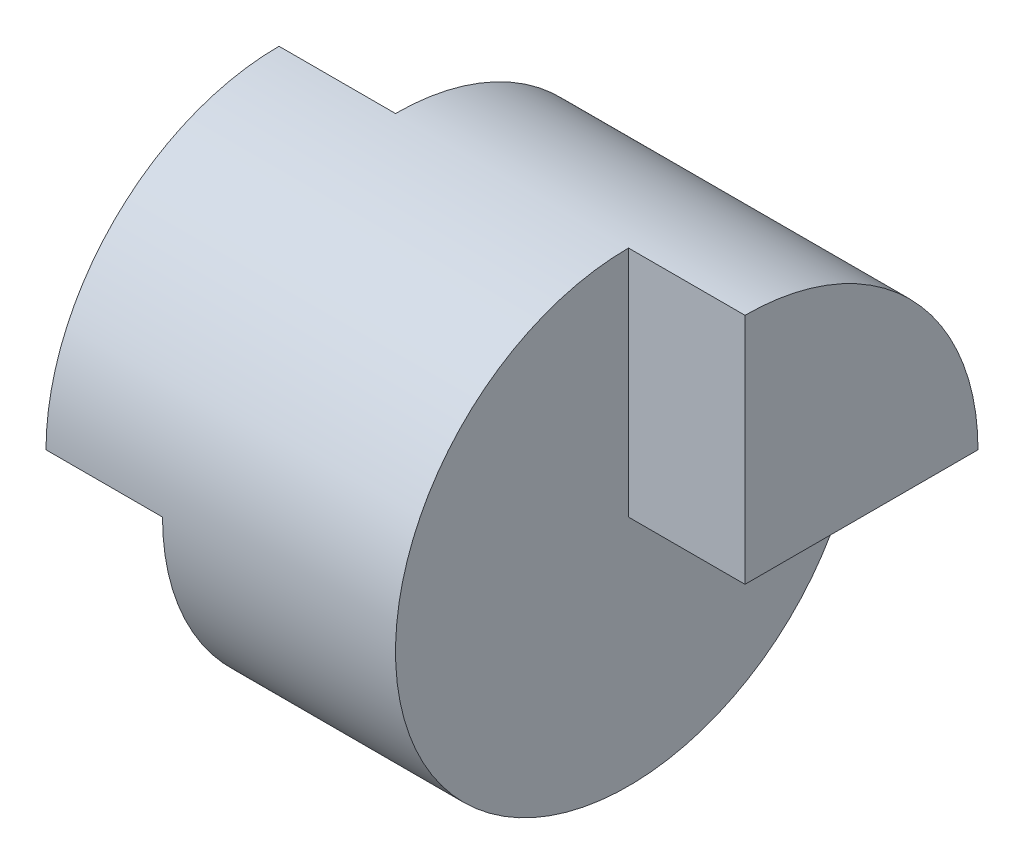
ISO-10303-21;
HEADER;
FILE_DESCRIPTION(('STEP AP214'),'2;1');
FILE_NAME('part.step','',(''),(''),'','','');
FILE_SCHEMA(('AUTOMOTIVE_DESIGN { 1 0 10303 214 1 1 1 1 }'));
ENDSEC;
DATA;
#1=APPLICATION_CONTEXT('core data for automotive mechanical design processes');
#2=APPLICATION_PROTOCOL_DEFINITION('international standard','automotive_design',2000,#1);
#3=PRODUCT_CONTEXT('',#1,'mechanical');
#4=PRODUCT('Part','Part','',(#3));
#5=PRODUCT_RELATED_PRODUCT_CATEGORY('part','',(#4));
#6=PRODUCT_DEFINITION_FORMATION('','',#4);
#7=PRODUCT_DEFINITION_CONTEXT('part definition',#1,'design');
#8=PRODUCT_DEFINITION('design','',#6,#7);
#9=PRODUCT_DEFINITION_SHAPE('','',#8);
#10=(LENGTH_UNIT() NAMED_UNIT(*) SI_UNIT(.MILLI.,.METRE.));
#11=(NAMED_UNIT(*) PLANE_ANGLE_UNIT() SI_UNIT($,.RADIAN.));
#12=(NAMED_UNIT(*) SI_UNIT($,.STERADIAN.) SOLID_ANGLE_UNIT());
#13=UNCERTAINTY_MEASURE_WITH_UNIT(LENGTH_MEASURE(1.E-05),#10,'distance_accuracy_value','');
#14=(GEOMETRIC_REPRESENTATION_CONTEXT(3) GLOBAL_UNCERTAINTY_ASSIGNED_CONTEXT((#13)) GLOBAL_UNIT_ASSIGNED_CONTEXT((#10,
#11,#12)) REPRESENTATION_CONTEXT('',''));
#15=CARTESIAN_POINT('',(0.,0.,0.));
#16=DIRECTION('',(0.,0.,1.));
#17=DIRECTION('',(1.,0.,0.));
#18=AXIS2_PLACEMENT_3D('',#15,#16,#17);
#19=CARTESIAN_POINT('',(0.,0.,0.));
#20=DIRECTION('',(-1.,0.,0.));
#21=DIRECTION('',(0.,0.,1.));
#22=AXIS2_PLACEMENT_3D('',#19,#20,#21);
#23=CYLINDRICAL_SURFACE('',#22,2.);
#24=CARTESIAN_POINT('',(3.,0.,0.));
#25=DIRECTION('',(1.,0.,0.));
#26=DIRECTION('',(0.,0.,-1.));
#27=AXIS2_PLACEMENT_3D('',#24,#25,#26);
#28=CIRCLE('',#27,2.);
#29=CARTESIAN_POINT('',(3.,0.,-2.));
#30=VERTEX_POINT('',#29);
#31=CARTESIAN_POINT('',(3.,2.,0.));
#32=VERTEX_POINT('',#31);
#33=EDGE_CURVE('E11',#30,#32,#28,.F.);
#34=ORIENTED_EDGE('',*,*,#33,.T.);
#35=DIRECTION('',(-1.,0.,0.));
#36=VECTOR('',#35,1.);
#37=CARTESIAN_POINT('',(0.,2.,0.));
#38=LINE('',#37,#36);
#39=CARTESIAN_POINT('',(4.,2.,0.));
#40=VERTEX_POINT('',#39);
#41=EDGE_CURVE('E131',#32,#40,#38,.F.);
#42=ORIENTED_EDGE('',*,*,#41,.T.);
#43=CARTESIAN_POINT('',(4.,0.,0.));
#44=DIRECTION('',(-1.,0.,0.));
#45=DIRECTION('',(0.,0.,1.));
#46=AXIS2_PLACEMENT_3D('',#43,#44,#45);
#47=CIRCLE('',#46,2.);
#48=CARTESIAN_POINT('',(4.,0.,-2.));
#49=VERTEX_POINT('',#48);
#50=EDGE_CURVE('E47',#40,#49,#47,.T.);
#51=ORIENTED_EDGE('',*,*,#50,.T.);
#52=DIRECTION('',(-1.,0.,0.));
#53=VECTOR('',#52,1.);
#54=CARTESIAN_POINT('',(0.,0.,-2.));
#55=LINE('',#54,#53);
#56=EDGE_CURVE('E119',#30,#49,#55,.F.);
#57=ORIENTED_EDGE('',*,*,#56,.F.);
#58=EDGE_LOOP('',(#34,#42,#51,#57));
#59=FACE_BOUND('',#58,.T.);
#60=CARTESIAN_POINT('',(1.,0.,0.));
#61=DIRECTION('',(-1.,0.,0.));
#62=DIRECTION('',(0.,-1.,0.));
#63=AXIS2_PLACEMENT_3D('',#60,#61,#62);
#64=CIRCLE('',#63,2.);
#65=CARTESIAN_POINT('',(1.,0.,2.));
#66=VERTEX_POINT('',#65);
#67=CARTESIAN_POINT('',(1.,2.,0.));
#68=VERTEX_POINT('',#67);
#69=EDGE_CURVE('E105',#66,#68,#64,.F.);
#70=ORIENTED_EDGE('',*,*,#69,.T.);
#71=DIRECTION('',(-1.,0.,0.));
#72=VECTOR('',#71,1.);
#73=CARTESIAN_POINT('',(0.,2.,0.));
#74=LINE('',#73,#72);
#75=CARTESIAN_POINT('',(0.,2.,0.));
#76=VERTEX_POINT('',#75);
#77=EDGE_CURVE('E126',#68,#76,#74,.T.);
#78=ORIENTED_EDGE('',*,*,#77,.T.);
#79=CARTESIAN_POINT('',(0.,0.,0.));
#80=DIRECTION('',(-1.,0.,0.));
#81=DIRECTION('',(0.,0.,1.));
#82=AXIS2_PLACEMENT_3D('',#79,#80,#81);
#83=CIRCLE('',#82,2.);
#84=CARTESIAN_POINT('',(0.,0.,2.));
#85=VERTEX_POINT('',#84);
#86=EDGE_CURVE('E100',#85,#76,#83,.T.);
#87=ORIENTED_EDGE('',*,*,#86,.F.);
#88=DIRECTION('',(-1.,0.,0.));
#89=VECTOR('',#88,1.);
#90=CARTESIAN_POINT('',(0.,0.,2.));
#91=LINE('',#90,#89);
#92=EDGE_CURVE('E104',#66,#85,#91,.T.);
#93=ORIENTED_EDGE('',*,*,#92,.F.);
#94=EDGE_LOOP('',(#70,#78,#87,#93));
#95=FACE_BOUND('',#94,.T.);
#96=ADVANCED_FACE('F33',(#59,#95),#23,.T.);
#97=CARTESIAN_POINT('',(0.,-2.,0.));
#98=DIRECTION('',(1.,0.,0.));
#99=DIRECTION('',(0.,0.,-1.));
#100=AXIS2_PLACEMENT_3D('',#97,#98,#99);
#101=PLANE('',#100);
#102=DIRECTION('',(0.,-1.,0.));
#103=VECTOR('',#102,1.);
#104=CARTESIAN_POINT('',(0.,10.,0.));
#105=LINE('',#104,#103);
#106=CARTESIAN_POINT('',(0.,0.,0.));
#107=VERTEX_POINT('',#106);
#108=EDGE_CURVE('E90',#76,#107,#105,.T.);
#109=ORIENTED_EDGE('',*,*,#108,.T.);
#110=DIRECTION('',(0.,0.,1.));
#111=VECTOR('',#110,1.);
#112=CARTESIAN_POINT('',(0.,0.,0.));
#113=LINE('',#112,#111);
#114=EDGE_CURVE('E55',#107,#85,#113,.T.);
#115=ORIENTED_EDGE('',*,*,#114,.T.);
#116=ORIENTED_EDGE('',*,*,#86,.T.);
#117=EDGE_LOOP('',(#109,#115,#116));
#118=FACE_BOUND('',#117,.T.);
#119=ADVANCED_FACE('F98',(#118),#101,.F.);
#120=CARTESIAN_POINT('',(4.,0.,0.));
#121=DIRECTION('',(-1.,0.,0.));
#122=DIRECTION('',(0.,0.,1.));
#123=AXIS2_PLACEMENT_3D('',#120,#121,#122);
#124=PLANE('',#123);
#125=DIRECTION('',(0.,-1.,0.));
#126=VECTOR('',#125,1.);
#127=CARTESIAN_POINT('',(4.,10.,0.));
#128=LINE('',#127,#126);
#129=CARTESIAN_POINT('',(4.,0.,0.));
#130=VERTEX_POINT('',#129);
#131=EDGE_CURVE('E115',#40,#130,#128,.T.);
#132=ORIENTED_EDGE('',*,*,#131,.T.);
#133=DIRECTION('',(0.,0.,-1.));
#134=VECTOR('',#133,1.);
#135=CARTESIAN_POINT('',(4.,0.,0.));
#136=LINE('',#135,#134);
#137=EDGE_CURVE('E40',#130,#49,#136,.T.);
#138=ORIENTED_EDGE('',*,*,#137,.T.);
#139=ORIENTED_EDGE('',*,*,#50,.F.);
#140=EDGE_LOOP('',(#132,#138,#139));
#141=FACE_BOUND('',#140,.T.);
#142=ADVANCED_FACE('F114',(#141),#124,.F.);
#143=CARTESIAN_POINT('',(0.,0.,-5.5));
#144=DIRECTION('',(0.,1.,0.));
#145=DIRECTION('',(-1.,0.,0.));
#146=AXIS2_PLACEMENT_3D('',#143,#144,#145);
#147=PLANE('',#146);
#148=DIRECTION('',(1.,0.,0.));
#149=VECTOR('',#148,1.);
#150=CARTESIAN_POINT('',(0.,0.,0.));
#151=LINE('',#150,#149);
#152=CARTESIAN_POINT('',(1.,0.,0.));
#153=VERTEX_POINT('',#152);
#154=EDGE_CURVE('E87',#107,#153,#151,.T.);
#155=ORIENTED_EDGE('',*,*,#154,.T.);
#156=DIRECTION('',(0.,0.,1.));
#157=VECTOR('',#156,1.);
#158=CARTESIAN_POINT('',(1.,0.,-5.5));
#159=LINE('',#158,#157);
#160=EDGE_CURVE('E123',#153,#66,#159,.T.);
#161=ORIENTED_EDGE('',*,*,#160,.T.);
#162=ORIENTED_EDGE('',*,*,#92,.T.);
#163=ORIENTED_EDGE('',*,*,#114,.F.);
#164=EDGE_LOOP('',(#155,#161,#162,#163));
#165=FACE_BOUND('',#164,.T.);
#166=ADVANCED_FACE('F102',(#165),#147,.F.);
#167=CARTESIAN_POINT('',(0.,0.,-5.5));
#168=DIRECTION('',(0.,1.,0.));
#169=DIRECTION('',(-1.,0.,0.));
#170=AXIS2_PLACEMENT_3D('',#167,#168,#169);
#171=PLANE('',#170);
#172=DIRECTION('',(-1.,0.,0.));
#173=VECTOR('',#172,1.);
#174=CARTESIAN_POINT('',(0.,0.,0.));
#175=LINE('',#174,#173);
#176=CARTESIAN_POINT('',(3.,0.,0.));
#177=VERTEX_POINT('',#176);
#178=EDGE_CURVE('E134',#130,#177,#175,.T.);
#179=ORIENTED_EDGE('',*,*,#178,.T.);
#180=DIRECTION('',(0.,0.,1.));
#181=VECTOR('',#180,1.);
#182=CARTESIAN_POINT('',(3.,0.,-5.5));
#183=LINE('',#182,#181);
#184=EDGE_CURVE('E122',#30,#177,#183,.T.);
#185=ORIENTED_EDGE('',*,*,#184,.F.);
#186=ORIENTED_EDGE('',*,*,#56,.T.);
#187=ORIENTED_EDGE('',*,*,#137,.F.);
#188=EDGE_LOOP('',(#179,#185,#186,#187));
#189=FACE_BOUND('',#188,.T.);
#190=ADVANCED_FACE('F120',(#189),#171,.F.);
#191=CARTESIAN_POINT('',(1.,0.,-5.5));
#192=DIRECTION('',(-1.,0.,0.));
#193=DIRECTION('',(0.,-1.,0.));
#194=AXIS2_PLACEMENT_3D('',#191,#192,#193);
#195=PLANE('',#194);
#196=ORIENTED_EDGE('',*,*,#69,.F.);
#197=ORIENTED_EDGE('',*,*,#160,.F.);
#198=DIRECTION('',(0.,-1.,0.));
#199=VECTOR('',#198,1.);
#200=CARTESIAN_POINT('',(0.999999999999999,10.,0.));
#201=LINE('',#200,#199);
#202=EDGE_CURVE('E93',#68,#153,#201,.T.);
#203=ORIENTED_EDGE('',*,*,#202,.F.);
#204=EDGE_LOOP('',(#196,#197,#203));
#205=FACE_BOUND('',#204,.T.);
#206=ADVANCED_FACE('F151',(#205),#195,.T.);
#207=CARTESIAN_POINT('',(3.,0.,-5.5));
#208=DIRECTION('',(1.,0.,0.));
#209=DIRECTION('',(0.,0.,-1.));
#210=AXIS2_PLACEMENT_3D('',#207,#208,#209);
#211=PLANE('',#210);
#212=ORIENTED_EDGE('',*,*,#184,.T.);
#213=DIRECTION('',(0.,-1.,0.));
#214=VECTOR('',#213,1.);
#215=CARTESIAN_POINT('',(3.,10.,0.));
#216=LINE('',#215,#214);
#217=EDGE_CURVE('E96',#32,#177,#216,.T.);
#218=ORIENTED_EDGE('',*,*,#217,.F.);
#219=ORIENTED_EDGE('',*,*,#33,.F.);
#220=EDGE_LOOP('',(#212,#218,#219));
#221=FACE_BOUND('',#220,.T.);
#222=ADVANCED_FACE('F140',(#221),#211,.T.);
#223=CARTESIAN_POINT('',(0.,10.,0.));
#224=DIRECTION('',(0.,0.,1.));
#225=DIRECTION('',(1.,0.,0.));
#226=AXIS2_PLACEMENT_3D('',#223,#224,#225);
#227=PLANE('',#226);
#228=ORIENTED_EDGE('',*,*,#217,.T.);
#229=ORIENTED_EDGE('',*,*,#178,.F.);
#230=ORIENTED_EDGE('',*,*,#131,.F.);
#231=ORIENTED_EDGE('',*,*,#41,.F.);
#232=EDGE_LOOP('',(#228,#229,#230,#231));
#233=FACE_BOUND('',#232,.T.);
#234=ADVANCED_FACE('F143',(#233),#227,.T.);
#235=CARTESIAN_POINT('',(0.,10.,0.));
#236=DIRECTION('',(0.,0.,-1.));
#237=DIRECTION('',(-1.,0.,0.));
#238=AXIS2_PLACEMENT_3D('',#235,#236,#237);
#239=PLANE('',#238);
#240=ORIENTED_EDGE('',*,*,#202,.T.);
#241=ORIENTED_EDGE('',*,*,#154,.F.);
#242=ORIENTED_EDGE('',*,*,#108,.F.);
#243=ORIENTED_EDGE('',*,*,#77,.F.);
#244=EDGE_LOOP('',(#240,#241,#242,#243));
#245=FACE_BOUND('',#244,.T.);
#246=ADVANCED_FACE('F88',(#245),#239,.T.);
#247=CLOSED_SHELL('',(#96,#119,#142,#166,#190,#206,#222,#234,#246));
#248=MANIFOLD_SOLID_BREP('B2',#247);
#249=ADVANCED_BREP_SHAPE_REPRESENTATION('',(#18,#248),#14);
#250=SHAPE_DEFINITION_REPRESENTATION(#9,#249);
ENDSEC;
END-ISO-10303-21;
